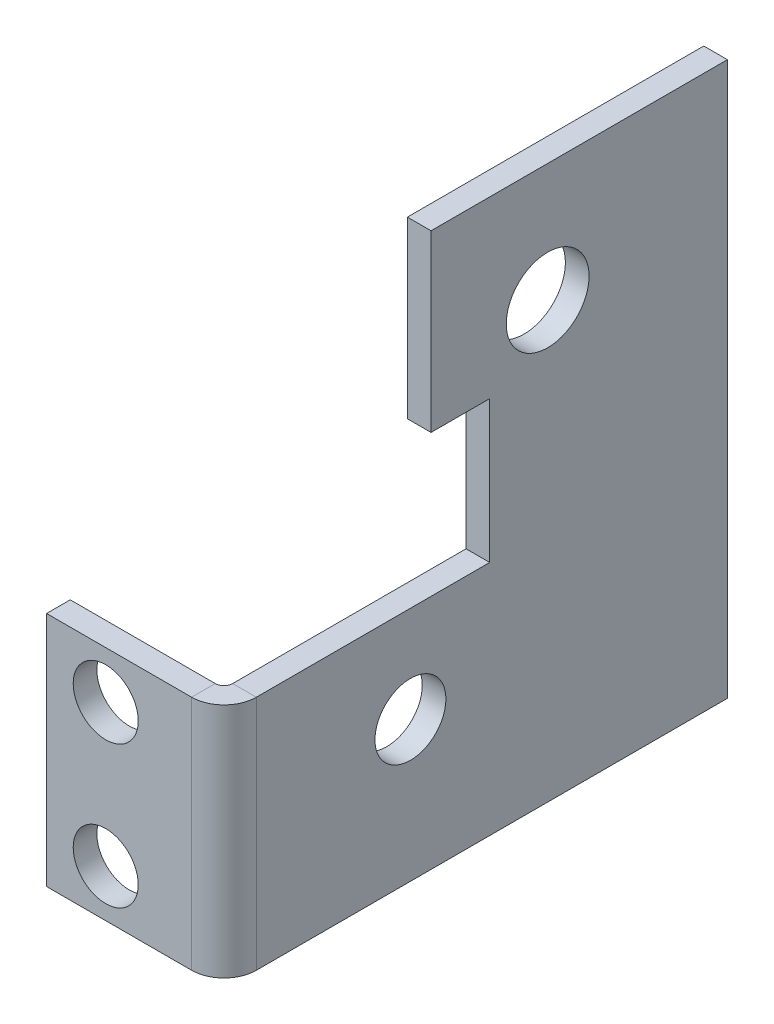
ISO-10303-21;
HEADER;
FILE_DESCRIPTION(('STEP AP214'),'2;1');
FILE_NAME('part.step','',(''),(''),'','','');
FILE_SCHEMA(('AUTOMOTIVE_DESIGN { 1 0 10303 214 1 1 1 1 }'));
ENDSEC;
DATA;
#1=APPLICATION_CONTEXT('core data for automotive mechanical design processes');
#2=APPLICATION_PROTOCOL_DEFINITION('international standard','automotive_design',2000,#1);
#3=PRODUCT_CONTEXT('',#1,'mechanical');
#4=PRODUCT('Part','Part','',(#3));
#5=PRODUCT_RELATED_PRODUCT_CATEGORY('part','',(#4));
#6=PRODUCT_DEFINITION_FORMATION('','',#4);
#7=PRODUCT_DEFINITION_CONTEXT('part definition',#1,'design');
#8=PRODUCT_DEFINITION('design','',#6,#7);
#9=PRODUCT_DEFINITION_SHAPE('','',#8);
#10=(LENGTH_UNIT() NAMED_UNIT(*) SI_UNIT(.MILLI.,.METRE.));
#11=(NAMED_UNIT(*) PLANE_ANGLE_UNIT() SI_UNIT($,.RADIAN.));
#12=(NAMED_UNIT(*) SI_UNIT($,.STERADIAN.) SOLID_ANGLE_UNIT());
#13=UNCERTAINTY_MEASURE_WITH_UNIT(LENGTH_MEASURE(1.E-05),#10,'distance_accuracy_value','');
#14=(GEOMETRIC_REPRESENTATION_CONTEXT(3) GLOBAL_UNCERTAINTY_ASSIGNED_CONTEXT((#13)) GLOBAL_UNIT_ASSIGNED_CONTEXT((#10,
#11,#12)) REPRESENTATION_CONTEXT('',''));
#15=CARTESIAN_POINT('',(0.,0.,0.));
#16=DIRECTION('',(0.,0.,1.));
#17=DIRECTION('',(1.,0.,0.));
#18=AXIS2_PLACEMENT_3D('',#15,#16,#17);
#19=CARTESIAN_POINT('',(2.,0.,-35.2));
#20=DIRECTION('',(-1.,0.,0.));
#21=DIRECTION('',(0.,0.,-1.));
#22=AXIS2_PLACEMENT_3D('',#19,#20,#21);
#23=PLANE('',#22);
#24=CARTESIAN_POINT('',(2.,40.,-20.));
#25=DIRECTION('',(1.,0.,0.));
#26=DIRECTION('',(0.,0.,-1.));
#27=AXIS2_PLACEMENT_3D('',#24,#25,#26);
#28=CIRCLE('',#27,3.5);
#29=CARTESIAN_POINT('',(2.,40.,-23.5));
#30=VERTEX_POINT('',#29);
#31=EDGE_CURVE('E219',#30,#30,#28,.T.);
#32=ORIENTED_EDGE('',*,*,#31,.F.);
#33=EDGE_LOOP('',(#32));
#34=FACE_BOUND('',#33,.T.);
#35=CARTESIAN_POINT('',(2.,15.0902098695956,-8.3960026));
#36=DIRECTION('',(1.,0.,0.));
#37=DIRECTION('',(0.,0.,-1.));
#38=AXIS2_PLACEMENT_3D('',#35,#36,#37);
#39=CIRCLE('',#38,3.);
#40=CARTESIAN_POINT('',(2.,15.0902098695956,-11.3960026));
#41=VERTEX_POINT('',#40);
#42=EDGE_CURVE('E191',#41,#41,#39,.T.);
#43=ORIENTED_EDGE('',*,*,#42,.F.);
#44=EDGE_LOOP('',(#43));
#45=FACE_BOUND('',#44,.T.);
#46=DIRECTION('',(0.,-1.,0.));
#47=VECTOR('',#46,1.);
#48=CARTESIAN_POINT('',(2.,3.23,4.6334));
#49=LINE('',#48,#47);
#50=CARTESIAN_POINT('',(2.,3.23,4.6334));
#51=VERTEX_POINT('',#50);
#52=CARTESIAN_POINT('',(2.,23.23,4.6334));
#53=VERTEX_POINT('',#52);
#54=EDGE_CURVE('E163',#51,#53,#49,.F.);
#55=ORIENTED_EDGE('',*,*,#54,.F.);
#56=DIRECTION('',(0.,0.,-1.));
#57=VECTOR('',#56,1.);
#58=CARTESIAN_POINT('',(2.,3.23,-35.2));
#59=LINE('',#58,#57);
#60=CARTESIAN_POINT('',(2.,3.23,-35.2));
#61=VERTEX_POINT('',#60);
#62=EDGE_CURVE('E227',#51,#61,#59,.T.);
#63=ORIENTED_EDGE('',*,*,#62,.T.);
#64=DIRECTION('',(0.,1.,0.));
#65=VECTOR('',#64,1.);
#66=CARTESIAN_POINT('',(2.,0.,-35.2));
#67=LINE('',#66,#65);
#68=CARTESIAN_POINT('',(2.,50.,-35.2));
#69=VERTEX_POINT('',#68);
#70=EDGE_CURVE('E230',#61,#69,#67,.T.);
#71=ORIENTED_EDGE('',*,*,#70,.T.);
#72=DIRECTION('',(0.,0.,1.));
#73=VECTOR('',#72,1.);
#74=CARTESIAN_POINT('',(2.,50.,-35.2));
#75=LINE('',#74,#73);
#76=CARTESIAN_POINT('',(2.,50.,-10.14));
#77=VERTEX_POINT('',#76);
#78=EDGE_CURVE('E11',#69,#77,#75,.T.);
#79=ORIENTED_EDGE('',*,*,#78,.T.);
#80=DIRECTION('',(0.,1.,0.));
#81=VECTOR('',#80,1.);
#82=CARTESIAN_POINT('',(2.,0.,-10.14));
#83=LINE('',#82,#81);
#84=CARTESIAN_POINT('',(2.,35.23,-10.14));
#85=VERTEX_POINT('',#84);
#86=EDGE_CURVE('E184',#85,#77,#83,.T.);
#87=ORIENTED_EDGE('',*,*,#86,.F.);
#88=DIRECTION('',(0.,0.,1.));
#89=VECTOR('',#88,1.);
#90=CARTESIAN_POINT('',(2.,35.23,-35.2));
#91=LINE('',#90,#89);
#92=CARTESIAN_POINT('',(2.,35.23,-15.1));
#93=VERTEX_POINT('',#92);
#94=EDGE_CURVE('E206',#93,#85,#91,.T.);
#95=ORIENTED_EDGE('',*,*,#94,.F.);
#96=DIRECTION('',(0.,1.,0.));
#97=VECTOR('',#96,1.);
#98=CARTESIAN_POINT('',(2.,0.,-15.1));
#99=LINE('',#98,#97);
#100=CARTESIAN_POINT('',(2.,23.23,-15.1));
#101=VERTEX_POINT('',#100);
#102=EDGE_CURVE('E213',#101,#93,#99,.T.);
#103=ORIENTED_EDGE('',*,*,#102,.F.);
#104=DIRECTION('',(0.,0.,-1.));
#105=VECTOR('',#104,1.);
#106=CARTESIAN_POINT('',(2.,23.23,-35.2));
#107=LINE('',#106,#105);
#108=EDGE_CURVE('E210',#53,#101,#107,.T.);
#109=ORIENTED_EDGE('',*,*,#108,.F.);
#110=EDGE_LOOP('',(#55,#63,#71,#79,#87,#95,#103,#109));
#111=FACE_BOUND('',#110,.T.);
#112=ADVANCED_FACE('F39',(#34,#45,#111),#23,.F.);
#113=CARTESIAN_POINT('',(0.,0.,-35.2));
#114=DIRECTION('',(-1.,0.,0.));
#115=DIRECTION('',(0.,0.,-1.));
#116=AXIS2_PLACEMENT_3D('',#113,#114,#115);
#117=PLANE('',#116);
#118=CARTESIAN_POINT('',(0.,15.0902098695956,-8.3960026));
#119=DIRECTION('',(1.,0.,0.));
#120=DIRECTION('',(0.,0.,-1.));
#121=AXIS2_PLACEMENT_3D('',#118,#119,#120);
#122=CIRCLE('',#121,3.);
#123=CARTESIAN_POINT('',(0.,15.0902098695956,-11.3960026));
#124=VERTEX_POINT('',#123);
#125=EDGE_CURVE('E188',#124,#124,#122,.T.);
#126=ORIENTED_EDGE('',*,*,#125,.T.);
#127=EDGE_LOOP('',(#126));
#128=FACE_BOUND('',#127,.T.);
#129=CARTESIAN_POINT('',(0.,40.,-20.));
#130=DIRECTION('',(1.,0.,0.));
#131=DIRECTION('',(0.,0.,-1.));
#132=AXIS2_PLACEMENT_3D('',#129,#130,#131);
#133=CIRCLE('',#132,3.5);
#134=CARTESIAN_POINT('',(0.,40.,-23.5));
#135=VERTEX_POINT('',#134);
#136=EDGE_CURVE('E216',#135,#135,#133,.T.);
#137=ORIENTED_EDGE('',*,*,#136,.T.);
#138=EDGE_LOOP('',(#137));
#139=FACE_BOUND('',#138,.T.);
#140=DIRECTION('',(0.,0.,-1.));
#141=VECTOR('',#140,1.);
#142=CARTESIAN_POINT('',(0.,23.23,-15.1));
#143=LINE('',#142,#141);
#144=CARTESIAN_POINT('',(0.,23.23,4.6334));
#145=VERTEX_POINT('',#144);
#146=CARTESIAN_POINT('',(0.,23.23,-15.1));
#147=VERTEX_POINT('',#146);
#148=EDGE_CURVE('E200',#145,#147,#143,.T.);
#149=ORIENTED_EDGE('',*,*,#148,.T.);
#150=DIRECTION('',(0.,1.,0.));
#151=VECTOR('',#150,1.);
#152=CARTESIAN_POINT('',(0.,35.23,-15.1));
#153=LINE('',#152,#151);
#154=CARTESIAN_POINT('',(0.,35.23,-15.1));
#155=VERTEX_POINT('',#154);
#156=EDGE_CURVE('E194',#147,#155,#153,.T.);
#157=ORIENTED_EDGE('',*,*,#156,.T.);
#158=DIRECTION('',(0.,0.,1.));
#159=VECTOR('',#158,1.);
#160=CARTESIAN_POINT('',(0.,35.23,-15.1));
#161=LINE('',#160,#159);
#162=CARTESIAN_POINT('',(0.,35.23,-10.14));
#163=VERTEX_POINT('',#162);
#164=EDGE_CURVE('E197',#155,#163,#161,.T.);
#165=ORIENTED_EDGE('',*,*,#164,.T.);
#166=DIRECTION('',(0.,1.,0.));
#167=VECTOR('',#166,1.);
#168=CARTESIAN_POINT('',(0.,35.23,-10.14));
#169=LINE('',#168,#167);
#170=CARTESIAN_POINT('',(0.,50.,-10.14));
#171=VERTEX_POINT('',#170);
#172=EDGE_CURVE('E177',#163,#171,#169,.T.);
#173=ORIENTED_EDGE('',*,*,#172,.T.);
#174=DIRECTION('',(0.,0.,1.));
#175=VECTOR('',#174,1.);
#176=CARTESIAN_POINT('',(0.,50.,-35.2));
#177=LINE('',#176,#175);
#178=CARTESIAN_POINT('',(0.,50.,-35.2));
#179=VERTEX_POINT('',#178);
#180=EDGE_CURVE('E46',#179,#171,#177,.T.);
#181=ORIENTED_EDGE('',*,*,#180,.F.);
#182=DIRECTION('',(0.,1.,0.));
#183=VECTOR('',#182,1.);
#184=CARTESIAN_POINT('',(0.,0.,-35.2));
#185=LINE('',#184,#183);
#186=CARTESIAN_POINT('',(0.,3.23,-35.2));
#187=VERTEX_POINT('',#186);
#188=EDGE_CURVE('E235',#187,#179,#185,.T.);
#189=ORIENTED_EDGE('',*,*,#188,.F.);
#190=DIRECTION('',(0.,0.,1.));
#191=VECTOR('',#190,1.);
#192=CARTESIAN_POINT('',(0.,3.23,-35.2));
#193=LINE('',#192,#191);
#194=CARTESIAN_POINT('',(0.,3.23,4.6334));
#195=VERTEX_POINT('',#194);
#196=EDGE_CURVE('E222',#187,#195,#193,.T.);
#197=ORIENTED_EDGE('',*,*,#196,.T.);
#198=DIRECTION('',(0.,-1.,0.));
#199=VECTOR('',#198,1.);
#200=CARTESIAN_POINT('',(0.,3.23,4.6334));
#201=LINE('',#200,#199);
#202=EDGE_CURVE('E166',#195,#145,#201,.F.);
#203=ORIENTED_EDGE('',*,*,#202,.T.);
#204=EDGE_LOOP('',(#149,#157,#165,#173,#181,#189,#197,#203));
#205=FACE_BOUND('',#204,.T.);
#206=ADVANCED_FACE('F245',(#128,#139,#205),#117,.T.);
#207=CARTESIAN_POINT('',(0.,3.23,0.));
#208=DIRECTION('',(0.,-1.,0.));
#209=DIRECTION('',(0.,0.,1.));
#210=AXIS2_PLACEMENT_3D('',#207,#208,#209);
#211=PLANE('',#210);
#212=ORIENTED_EDGE('',*,*,#196,.F.);
#213=DIRECTION('',(-1.,0.,0.));
#214=VECTOR('',#213,1.);
#215=CARTESIAN_POINT('',(0.,3.23,-35.2));
#216=LINE('',#215,#214);
#217=EDGE_CURVE('E225',#61,#187,#216,.T.);
#218=ORIENTED_EDGE('',*,*,#217,.F.);
#219=ORIENTED_EDGE('',*,*,#62,.F.);
#220=DIRECTION('',(1.,0.,0.));
#221=VECTOR('',#220,1.);
#222=CARTESIAN_POINT('',(0.,3.23,4.6334));
#223=LINE('',#222,#221);
#224=EDGE_CURVE('E161',#195,#51,#223,.T.);
#225=ORIENTED_EDGE('',*,*,#224,.F.);
#226=EDGE_LOOP('',(#212,#218,#219,#225));
#227=FACE_BOUND('',#226,.T.);
#228=ADVANCED_FACE('F259',(#227),#211,.T.);
#229=CARTESIAN_POINT('',(10.,23.23,-15.1));
#230=DIRECTION('',(0.,-1.,0.));
#231=DIRECTION('',(0.,0.,1.));
#232=AXIS2_PLACEMENT_3D('',#229,#230,#231);
#233=PLANE('',#232);
#234=DIRECTION('',(1.,0.,0.));
#235=VECTOR('',#234,1.);
#236=CARTESIAN_POINT('',(0.,23.23,4.6334));
#237=LINE('',#236,#235);
#238=EDGE_CURVE('E174',#145,#53,#237,.T.);
#239=ORIENTED_EDGE('',*,*,#238,.T.);
#240=ORIENTED_EDGE('',*,*,#108,.T.);
#241=DIRECTION('',(-1.,0.,0.));
#242=VECTOR('',#241,1.);
#243=CARTESIAN_POINT('',(10.,23.23,-15.1));
#244=LINE('',#243,#242);
#245=EDGE_CURVE('E204',#101,#147,#244,.T.);
#246=ORIENTED_EDGE('',*,*,#245,.T.);
#247=ORIENTED_EDGE('',*,*,#148,.F.);
#248=EDGE_LOOP('',(#239,#240,#246,#247));
#249=FACE_BOUND('',#248,.T.);
#250=ADVANCED_FACE('F338',(#249),#233,.F.);
#251=CARTESIAN_POINT('',(0.,0.,-35.2));
#252=DIRECTION('',(0.,0.,1.));
#253=DIRECTION('',(-1.,0.,0.));
#254=AXIS2_PLACEMENT_3D('',#251,#252,#253);
#255=PLANE('',#254);
#256=ORIENTED_EDGE('',*,*,#217,.T.);
#257=ORIENTED_EDGE('',*,*,#188,.T.);
#258=DIRECTION('',(1.,0.,0.));
#259=VECTOR('',#258,1.);
#260=CARTESIAN_POINT('',(0.,50.,-35.2));
#261=LINE('',#260,#259);
#262=EDGE_CURVE('E233',#179,#69,#261,.T.);
#263=ORIENTED_EDGE('',*,*,#262,.T.);
#264=ORIENTED_EDGE('',*,*,#70,.F.);
#265=EDGE_LOOP('',(#256,#257,#263,#264));
#266=FACE_BOUND('',#265,.T.);
#267=ADVANCED_FACE('F255',(#266),#255,.F.);
#268=CARTESIAN_POINT('',(0.,50.,-35.2));
#269=DIRECTION('',(0.,1.,0.));
#270=DIRECTION('',(0.,0.,-1.));
#271=AXIS2_PLACEMENT_3D('',#268,#269,#270);
#272=PLANE('',#271);
#273=DIRECTION('',(-1.,0.,0.));
#274=VECTOR('',#273,1.);
#275=CARTESIAN_POINT('',(8.,50.,-10.14));
#276=LINE('',#275,#274);
#277=EDGE_CURVE('E182',#77,#171,#276,.T.);
#278=ORIENTED_EDGE('',*,*,#277,.F.);
#279=ORIENTED_EDGE('',*,*,#78,.F.);
#280=ORIENTED_EDGE('',*,*,#262,.F.);
#281=ORIENTED_EDGE('',*,*,#180,.T.);
#282=EDGE_LOOP('',(#278,#279,#280,#281));
#283=FACE_BOUND('',#282,.T.);
#284=ADVANCED_FACE('F240',(#283),#272,.T.);
#285=CARTESIAN_POINT('',(10.,40.,-20.));
#286=DIRECTION('',(-1.,0.,0.));
#287=DIRECTION('',(0.,0.,-1.));
#288=AXIS2_PLACEMENT_3D('',#285,#286,#287);
#289=CYLINDRICAL_SURFACE('',#288,3.5);
#290=ORIENTED_EDGE('',*,*,#136,.F.);
#291=EDGE_LOOP('',(#290));
#292=FACE_BOUND('',#291,.T.);
#293=ORIENTED_EDGE('',*,*,#31,.T.);
#294=EDGE_LOOP('',(#293));
#295=FACE_BOUND('',#294,.T.);
#296=ADVANCED_FACE('F344',(#292,#295),#289,.F.);
#297=CARTESIAN_POINT('',(10.,35.23,-15.1));
#298=DIRECTION('',(0.,0.,-1.));
#299=DIRECTION('',(0.,-1.,0.));
#300=AXIS2_PLACEMENT_3D('',#297,#298,#299);
#301=PLANE('',#300);
#302=ORIENTED_EDGE('',*,*,#245,.F.);
#303=ORIENTED_EDGE('',*,*,#102,.T.);
#304=DIRECTION('',(-1.,0.,0.));
#305=VECTOR('',#304,1.);
#306=CARTESIAN_POINT('',(10.,35.23,-15.1));
#307=LINE('',#306,#305);
#308=EDGE_CURVE('E203',#93,#155,#307,.T.);
#309=ORIENTED_EDGE('',*,*,#308,.T.);
#310=ORIENTED_EDGE('',*,*,#156,.F.);
#311=EDGE_LOOP('',(#302,#303,#309,#310));
#312=FACE_BOUND('',#311,.T.);
#313=ADVANCED_FACE('F332',(#312),#301,.F.);
#314=CARTESIAN_POINT('',(10.,35.23,-15.1));
#315=DIRECTION('',(0.,1.,0.));
#316=DIRECTION('',(0.,0.,-1.));
#317=AXIS2_PLACEMENT_3D('',#314,#315,#316);
#318=PLANE('',#317);
#319=ORIENTED_EDGE('',*,*,#164,.F.);
#320=ORIENTED_EDGE('',*,*,#308,.F.);
#321=ORIENTED_EDGE('',*,*,#94,.T.);
#322=DIRECTION('',(-1.,0.,0.));
#323=VECTOR('',#322,1.);
#324=CARTESIAN_POINT('',(8.,35.23,-10.14));
#325=LINE('',#324,#323);
#326=EDGE_CURVE('E181',#85,#163,#325,.T.);
#327=ORIENTED_EDGE('',*,*,#326,.T.);
#328=EDGE_LOOP('',(#319,#320,#321,#327));
#329=FACE_BOUND('',#328,.T.);
#330=ADVANCED_FACE('F324',(#329),#318,.F.);
#331=CARTESIAN_POINT('',(10.,15.0902098695956,-8.3960026));
#332=DIRECTION('',(-1.,0.,0.));
#333=DIRECTION('',(0.,0.,-1.));
#334=AXIS2_PLACEMENT_3D('',#331,#332,#333);
#335=CYLINDRICAL_SURFACE('',#334,3.);
#336=ORIENTED_EDGE('',*,*,#125,.F.);
#337=EDGE_LOOP('',(#336));
#338=FACE_BOUND('',#337,.T.);
#339=ORIENTED_EDGE('',*,*,#42,.T.);
#340=EDGE_LOOP('',(#339));
#341=FACE_BOUND('',#340,.T.);
#342=ADVANCED_FACE('F322',(#338,#341),#335,.F.);
#343=CARTESIAN_POINT('',(8.,35.23,-10.14));
#344=DIRECTION('',(0.,0.,-1.));
#345=DIRECTION('',(1.,0.,0.));
#346=AXIS2_PLACEMENT_3D('',#343,#344,#345);
#347=PLANE('',#346);
#348=ORIENTED_EDGE('',*,*,#326,.F.);
#349=ORIENTED_EDGE('',*,*,#86,.T.);
#350=ORIENTED_EDGE('',*,*,#277,.T.);
#351=ORIENTED_EDGE('',*,*,#172,.F.);
#352=EDGE_LOOP('',(#348,#349,#350,#351));
#353=FACE_BOUND('',#352,.T.);
#354=ADVANCED_FACE('F248',(#353),#347,.F.);
#355=CARTESIAN_POINT('',(-0.736599999999997,23.23,4.6334));
#356=DIRECTION('',(0.,1.,0.));
#357=DIRECTION('',(0.,0.,-1.));
#358=AXIS2_PLACEMENT_3D('',#355,#356,#357);
#359=PLANE('',#358);
#360=DIRECTION('',(0.,0.,1.));
#361=VECTOR('',#360,1.);
#362=CARTESIAN_POINT('',(-0.736599999999997,23.23,7.37000000000004));
#363=LINE('',#362,#361);
#364=CARTESIAN_POINT('',(-0.736599999999994,23.23,5.37));
#365=VERTEX_POINT('',#364);
#366=CARTESIAN_POINT('',(-0.736599999999987,23.23,7.37));
#367=VERTEX_POINT('',#366);
#368=EDGE_CURVE('E262',#365,#367,#363,.T.);
#369=ORIENTED_EDGE('',*,*,#368,.T.);
#370=CARTESIAN_POINT('',(-0.736599999999997,23.23,4.6334));
#371=DIRECTION('',(0.,1.,0.));
#372=DIRECTION('',(0.,0.,1.));
#373=AXIS2_PLACEMENT_3D('',#370,#371,#372);
#374=CIRCLE('',#373,2.7366);
#375=EDGE_CURVE('E149',#53,#367,#374,.F.);
#376=ORIENTED_EDGE('',*,*,#375,.F.);
#377=ORIENTED_EDGE('',*,*,#238,.F.);
#378=CARTESIAN_POINT('',(-0.736599999999997,23.23,4.6334));
#379=DIRECTION('',(0.,1.,0.));
#380=DIRECTION('',(0.,0.,1.));
#381=AXIS2_PLACEMENT_3D('',#378,#379,#380);
#382=CIRCLE('',#381,0.7366);
#383=EDGE_CURVE('E61',#145,#365,#382,.F.);
#384=ORIENTED_EDGE('',*,*,#383,.T.);
#385=EDGE_LOOP('',(#369,#376,#377,#384));
#386=FACE_BOUND('',#385,.T.);
#387=ADVANCED_FACE('F266',(#386),#359,.T.);
#388=CARTESIAN_POINT('',(-0.736599999999997,3.23,4.6334));
#389=DIRECTION('',(0.,1.,0.));
#390=DIRECTION('',(0.,0.,-1.));
#391=AXIS2_PLACEMENT_3D('',#388,#389,#390);
#392=PLANE('',#391);
#393=CARTESIAN_POINT('',(-0.736599999999997,3.23,4.6334));
#394=DIRECTION('',(0.,1.,0.));
#395=DIRECTION('',(0.,0.,1.));
#396=AXIS2_PLACEMENT_3D('',#393,#394,#395);
#397=CIRCLE('',#396,0.7366);
#398=CARTESIAN_POINT('',(-0.736599999999994,3.23,5.37));
#399=VERTEX_POINT('',#398);
#400=EDGE_CURVE('E53',#399,#195,#397,.T.);
#401=ORIENTED_EDGE('',*,*,#400,.T.);
#402=ORIENTED_EDGE('',*,*,#224,.T.);
#403=CARTESIAN_POINT('',(-0.736599999999997,3.23,4.6334));
#404=DIRECTION('',(0.,1.,0.));
#405=DIRECTION('',(0.,0.,1.));
#406=AXIS2_PLACEMENT_3D('',#403,#404,#405);
#407=CIRCLE('',#406,2.7366);
#408=CARTESIAN_POINT('',(-0.736599999999997,3.23,7.37));
#409=VERTEX_POINT('',#408);
#410=EDGE_CURVE('E148',#409,#51,#407,.T.);
#411=ORIENTED_EDGE('',*,*,#410,.F.);
#412=DIRECTION('',(0.,0.,1.));
#413=VECTOR('',#412,1.);
#414=CARTESIAN_POINT('',(-0.736599999999997,3.23,5.37));
#415=LINE('',#414,#413);
#416=EDGE_CURVE('E152',#399,#409,#415,.T.);
#417=ORIENTED_EDGE('',*,*,#416,.F.);
#418=EDGE_LOOP('',(#401,#402,#411,#417));
#419=FACE_BOUND('',#418,.T.);
#420=ADVANCED_FACE('F160',(#419),#392,.F.);
#421=CARTESIAN_POINT('',(-0.736599999999997,3.23,4.6334));
#422=DIRECTION('',(0.,-1.,0.));
#423=DIRECTION('',(0.,0.,1.));
#424=AXIS2_PLACEMENT_3D('',#421,#422,#423);
#425=CYLINDRICAL_SURFACE('',#424,2.7366);
#426=ORIENTED_EDGE('',*,*,#54,.T.);
#427=ORIENTED_EDGE('',*,*,#375,.T.);
#428=DIRECTION('',(0.,-1.,0.));
#429=VECTOR('',#428,1.);
#430=CARTESIAN_POINT('',(-0.736599999999997,0.,7.37));
#431=LINE('',#430,#429);
#432=EDGE_CURVE('E135',#367,#409,#431,.T.);
#433=ORIENTED_EDGE('',*,*,#432,.T.);
#434=ORIENTED_EDGE('',*,*,#410,.T.);
#435=EDGE_LOOP('',(#426,#427,#433,#434));
#436=FACE_BOUND('',#435,.T.);
#437=ADVANCED_FACE('F146',(#436),#425,.T.);
#438=CARTESIAN_POINT('',(-0.736599999999997,3.23,4.6334));
#439=DIRECTION('',(0.,-1.,0.));
#440=DIRECTION('',(0.,0.,1.));
#441=AXIS2_PLACEMENT_3D('',#438,#439,#440);
#442=CYLINDRICAL_SURFACE('',#441,0.7366);
#443=ORIENTED_EDGE('',*,*,#202,.F.);
#444=ORIENTED_EDGE('',*,*,#400,.F.);
#445=DIRECTION('',(0.,1.,0.));
#446=VECTOR('',#445,1.);
#447=CARTESIAN_POINT('',(-0.736599999999997,23.23,5.37));
#448=LINE('',#447,#446);
#449=EDGE_CURVE('E158',#365,#399,#448,.F.);
#450=ORIENTED_EDGE('',*,*,#449,.F.);
#451=ORIENTED_EDGE('',*,*,#383,.F.);
#452=EDGE_LOOP('',(#443,#444,#450,#451));
#453=FACE_BOUND('',#452,.T.);
#454=ADVANCED_FACE('F260',(#453),#442,.F.);
#455=CARTESIAN_POINT('',(0.,3.23,7.37));
#456=DIRECTION('',(0.,-1.,0.));
#457=DIRECTION('',(0.,0.,1.));
#458=AXIS2_PLACEMENT_3D('',#455,#456,#457);
#459=PLANE('',#458);
#460=DIRECTION('',(1.,0.,0.));
#461=VECTOR('',#460,1.);
#462=CARTESIAN_POINT('',(0.,3.23,7.37));
#463=LINE('',#462,#461);
#464=CARTESIAN_POINT('',(-13.,3.23,7.37000000000004));
#465=VERTEX_POINT('',#464);
#466=EDGE_CURVE('E131',#465,#409,#463,.T.);
#467=ORIENTED_EDGE('',*,*,#466,.F.);
#468=DIRECTION('',(0.,0.,-1.));
#469=VECTOR('',#468,1.);
#470=CARTESIAN_POINT('',(-13.,3.23,7.37000000000004));
#471=LINE('',#470,#469);
#472=CARTESIAN_POINT('',(-13.,3.23,5.37000000000004));
#473=VERTEX_POINT('',#472);
#474=EDGE_CURVE('E173',#465,#473,#471,.T.);
#475=ORIENTED_EDGE('',*,*,#474,.T.);
#476=DIRECTION('',(-1.,0.,0.));
#477=VECTOR('',#476,1.);
#478=CARTESIAN_POINT('',(0.,3.23,5.37));
#479=LINE('',#478,#477);
#480=EDGE_CURVE('E156',#473,#399,#479,.F.);
#481=ORIENTED_EDGE('',*,*,#480,.T.);
#482=ORIENTED_EDGE('',*,*,#416,.T.);
#483=EDGE_LOOP('',(#467,#475,#481,#482));
#484=FACE_BOUND('',#483,.T.);
#485=ADVANCED_FACE('F154',(#484),#459,.T.);
#486=CARTESIAN_POINT('',(-13.,23.23,7.37000000000004));
#487=DIRECTION('',(0.,1.,0.));
#488=DIRECTION('',(0.,0.,-1.));
#489=AXIS2_PLACEMENT_3D('',#486,#487,#488);
#490=PLANE('',#489);
#491=DIRECTION('',(1.,0.,0.));
#492=VECTOR('',#491,1.);
#493=CARTESIAN_POINT('',(0.,23.23,5.37));
#494=LINE('',#493,#492);
#495=CARTESIAN_POINT('',(-13.,23.23,5.37000000000004));
#496=VERTEX_POINT('',#495);
#497=EDGE_CURVE('E151',#365,#496,#494,.F.);
#498=ORIENTED_EDGE('',*,*,#497,.T.);
#499=DIRECTION('',(0.,0.,-1.));
#500=VECTOR('',#499,1.);
#501=CARTESIAN_POINT('',(-13.,23.23,7.37000000000004));
#502=LINE('',#501,#500);
#503=CARTESIAN_POINT('',(-13.,23.23,7.37000000000004));
#504=VERTEX_POINT('',#503);
#505=EDGE_CURVE('E142',#504,#496,#502,.T.);
#506=ORIENTED_EDGE('',*,*,#505,.F.);
#507=DIRECTION('',(-1.,0.,0.));
#508=VECTOR('',#507,1.);
#509=CARTESIAN_POINT('',(-13.,23.23,7.37000000000004));
#510=LINE('',#509,#508);
#511=EDGE_CURVE('E271',#367,#504,#510,.T.);
#512=ORIENTED_EDGE('',*,*,#511,.F.);
#513=ORIENTED_EDGE('',*,*,#368,.F.);
#514=EDGE_LOOP('',(#498,#506,#512,#513));
#515=FACE_BOUND('',#514,.T.);
#516=ADVANCED_FACE('F269',(#515),#490,.T.);
#517=CARTESIAN_POINT('',(0.,0.,7.37));
#518=DIRECTION('',(0.,0.,1.));
#519=DIRECTION('',(-1.,0.,0.));
#520=AXIS2_PLACEMENT_3D('',#517,#518,#519);
#521=PLANE('',#520);
#522=CARTESIAN_POINT('',(-8.00000000000001,7.23,7.37000000000003));
#523=DIRECTION('',(0.,0.,-1.));
#524=DIRECTION('',(-1.,0.,0.));
#525=AXIS2_PLACEMENT_3D('',#522,#523,#524);
#526=CIRCLE('',#525,2.75);
#527=CARTESIAN_POINT('',(-10.75,7.23,7.37000000000004));
#528=VERTEX_POINT('',#527);
#529=EDGE_CURVE('E289',#528,#528,#526,.T.);
#530=ORIENTED_EDGE('',*,*,#529,.T.);
#531=EDGE_LOOP('',(#530));
#532=FACE_BOUND('',#531,.T.);
#533=CARTESIAN_POINT('',(-8.00000000000001,19.23,7.37000000000003));
#534=DIRECTION('',(0.,0.,-1.));
#535=DIRECTION('',(-1.,0.,0.));
#536=AXIS2_PLACEMENT_3D('',#533,#534,#535);
#537=CIRCLE('',#536,2.75);
#538=CARTESIAN_POINT('',(-10.75,19.23,7.37000000000004));
#539=VERTEX_POINT('',#538);
#540=EDGE_CURVE('E272',#539,#539,#537,.T.);
#541=ORIENTED_EDGE('',*,*,#540,.T.);
#542=EDGE_LOOP('',(#541));
#543=FACE_BOUND('',#542,.T.);
#544=ORIENTED_EDGE('',*,*,#511,.T.);
#545=DIRECTION('',(0.,-1.,0.));
#546=VECTOR('',#545,1.);
#547=CARTESIAN_POINT('',(-13.,3.23,7.37000000000004));
#548=LINE('',#547,#546);
#549=EDGE_CURVE('E137',#504,#465,#548,.T.);
#550=ORIENTED_EDGE('',*,*,#549,.T.);
#551=ORIENTED_EDGE('',*,*,#466,.T.);
#552=ORIENTED_EDGE('',*,*,#432,.F.);
#553=EDGE_LOOP('',(#544,#550,#551,#552));
#554=FACE_BOUND('',#553,.T.);
#555=ADVANCED_FACE('F134',(#532,#543,#554),#521,.T.);
#556=CARTESIAN_POINT('',(0.,0.,5.37));
#557=DIRECTION('',(0.,0.,1.));
#558=DIRECTION('',(-1.,0.,0.));
#559=AXIS2_PLACEMENT_3D('',#556,#557,#558);
#560=PLANE('',#559);
#561=CARTESIAN_POINT('',(-8.00000000000001,7.23,5.37));
#562=DIRECTION('',(0.,0.,1.));
#563=DIRECTION('',(1.,0.,0.));
#564=AXIS2_PLACEMENT_3D('',#561,#562,#563);
#565=CIRCLE('',#564,2.75);
#566=CARTESIAN_POINT('',(-5.25000000000001,7.23,5.37));
#567=VERTEX_POINT('',#566);
#568=EDGE_CURVE('E292',#567,#567,#565,.T.);
#569=ORIENTED_EDGE('',*,*,#568,.T.);
#570=EDGE_LOOP('',(#569));
#571=FACE_BOUND('',#570,.T.);
#572=CARTESIAN_POINT('',(-8.00000000000001,19.23,5.37));
#573=DIRECTION('',(0.,0.,1.));
#574=DIRECTION('',(1.,0.,0.));
#575=AXIS2_PLACEMENT_3D('',#572,#573,#574);
#576=CIRCLE('',#575,2.75);
#577=CARTESIAN_POINT('',(-5.25000000000001,19.23,5.37));
#578=VERTEX_POINT('',#577);
#579=EDGE_CURVE('E275',#578,#578,#576,.T.);
#580=ORIENTED_EDGE('',*,*,#579,.T.);
#581=EDGE_LOOP('',(#580));
#582=FACE_BOUND('',#581,.T.);
#583=ORIENTED_EDGE('',*,*,#449,.T.);
#584=ORIENTED_EDGE('',*,*,#480,.F.);
#585=DIRECTION('',(0.,1.,0.));
#586=VECTOR('',#585,1.);
#587=CARTESIAN_POINT('',(-13.,0.,5.37000000000004));
#588=LINE('',#587,#586);
#589=EDGE_CURVE('E279',#496,#473,#588,.F.);
#590=ORIENTED_EDGE('',*,*,#589,.F.);
#591=ORIENTED_EDGE('',*,*,#497,.F.);
#592=EDGE_LOOP('',(#583,#584,#590,#591));
#593=FACE_BOUND('',#592,.T.);
#594=ADVANCED_FACE('F296',(#571,#582,#593),#560,.F.);
#595=CARTESIAN_POINT('',(-13.,3.23,7.37000000000004));
#596=DIRECTION('',(-1.,0.,0.));
#597=DIRECTION('',(0.,0.,-1.));
#598=AXIS2_PLACEMENT_3D('',#595,#596,#597);
#599=PLANE('',#598);
#600=ORIENTED_EDGE('',*,*,#589,.T.);
#601=ORIENTED_EDGE('',*,*,#474,.F.);
#602=ORIENTED_EDGE('',*,*,#549,.F.);
#603=ORIENTED_EDGE('',*,*,#505,.T.);
#604=EDGE_LOOP('',(#600,#601,#602,#603));
#605=FACE_BOUND('',#604,.T.);
#606=ADVANCED_FACE('F307',(#605),#599,.T.);
#607=CARTESIAN_POINT('',(-8.00000000000001,19.23,14.88));
#608=DIRECTION('',(0.,0.,-1.));
#609=DIRECTION('',(1.,0.,0.));
#610=AXIS2_PLACEMENT_3D('',#607,#608,#609);
#611=CYLINDRICAL_SURFACE('',#610,2.75);
#612=ORIENTED_EDGE('',*,*,#540,.F.);
#613=EDGE_LOOP('',(#612));
#614=FACE_BOUND('',#613,.T.);
#615=ORIENTED_EDGE('',*,*,#579,.F.);
#616=EDGE_LOOP('',(#615));
#617=FACE_BOUND('',#616,.T.);
#618=ADVANCED_FACE('F301',(#614,#617),#611,.F.);
#619=CARTESIAN_POINT('',(-8.00000000000001,7.23,14.88));
#620=DIRECTION('',(0.,0.,-1.));
#621=DIRECTION('',(1.,0.,0.));
#622=AXIS2_PLACEMENT_3D('',#619,#620,#621);
#623=CYLINDRICAL_SURFACE('',#622,2.75);
#624=ORIENTED_EDGE('',*,*,#529,.F.);
#625=EDGE_LOOP('',(#624));
#626=FACE_BOUND('',#625,.T.);
#627=ORIENTED_EDGE('',*,*,#568,.F.);
#628=EDGE_LOOP('',(#627));
#629=FACE_BOUND('',#628,.T.);
#630=ADVANCED_FACE('F299',(#626,#629),#623,.F.);
#631=CLOSED_SHELL('',(#112,#206,#228,#250,#267,#284,#296,#313,#330,#342,#354,#387,#420,#437,
#454,#485,#516,#555,#594,#606,#618,#630));
#632=MANIFOLD_SOLID_BREP('B2',#631);
#633=ADVANCED_BREP_SHAPE_REPRESENTATION('',(#18,#632),#14);
#634=SHAPE_DEFINITION_REPRESENTATION(#9,#633);
ENDSEC;
END-ISO-10303-21;
